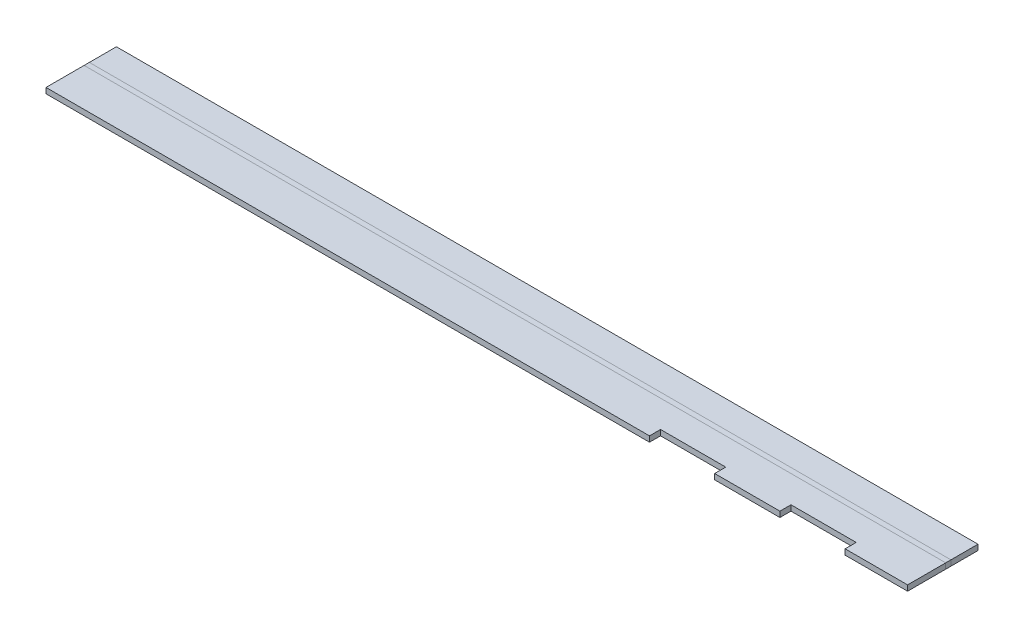
ISO-10303-21;
HEADER;
FILE_DESCRIPTION(('STEP AP214'),'2;1');
FILE_NAME('part.step','',(''),(''),'','','');
FILE_SCHEMA(('AUTOMOTIVE_DESIGN { 1 0 10303 214 1 1 1 1 }'));
ENDSEC;
DATA;
#1=APPLICATION_CONTEXT('core data for automotive mechanical design processes');
#2=APPLICATION_PROTOCOL_DEFINITION('international standard','automotive_design',2000,#1);
#3=PRODUCT_CONTEXT('',#1,'mechanical');
#4=PRODUCT('Part','Part','',(#3));
#5=PRODUCT_RELATED_PRODUCT_CATEGORY('part','',(#4));
#6=PRODUCT_DEFINITION_FORMATION('','',#4);
#7=PRODUCT_DEFINITION_CONTEXT('part definition',#1,'design');
#8=PRODUCT_DEFINITION('design','',#6,#7);
#9=PRODUCT_DEFINITION_SHAPE('','',#8);
#10=(LENGTH_UNIT() NAMED_UNIT(*) SI_UNIT(.MILLI.,.METRE.));
#11=(NAMED_UNIT(*) PLANE_ANGLE_UNIT() SI_UNIT($,.RADIAN.));
#12=(NAMED_UNIT(*) SI_UNIT($,.STERADIAN.) SOLID_ANGLE_UNIT());
#13=UNCERTAINTY_MEASURE_WITH_UNIT(LENGTH_MEASURE(1.E-05),#10,'distance_accuracy_value','');
#14=(GEOMETRIC_REPRESENTATION_CONTEXT(3) GLOBAL_UNCERTAINTY_ASSIGNED_CONTEXT((#13)) GLOBAL_UNIT_ASSIGNED_CONTEXT((#10,
#11,#12)) REPRESENTATION_CONTEXT('',''));
#15=CARTESIAN_POINT('',(0.,0.,0.));
#16=DIRECTION('',(0.,0.,1.));
#17=DIRECTION('',(1.,0.,0.));
#18=AXIS2_PLACEMENT_3D('',#15,#16,#17);
#19=CARTESIAN_POINT('',(19.7993,2.032,1.71258936020354));
#20=DIRECTION('',(0.,0.,-1.));
#21=DIRECTION('',(-1.,0.,0.));
#22=AXIS2_PLACEMENT_3D('',#19,#20,#21);
#23=PLANE('',#22);
#24=DIRECTION('',(1.,0.,0.));
#25=VECTOR('',#24,1.);
#26=CARTESIAN_POINT('',(19.7993,1.778,1.71258936020354));
#27=LINE('',#26,#25);
#28=CARTESIAN_POINT('',(13.9319,1.778,1.71258936020354));
#29=VERTEX_POINT('',#28);
#30=CARTESIAN_POINT('',(10.9347,1.778,1.71258936020354));
#31=VERTEX_POINT('',#30);
#32=EDGE_CURVE('E216',#29,#31,#27,.F.);
#33=ORIENTED_EDGE('',*,*,#32,.F.);
#34=DIRECTION('',(0.,1.,0.));
#35=VECTOR('',#34,1.);
#36=CARTESIAN_POINT('',(13.9319,-1.26194602583664,1.71258936020354));
#37=LINE('',#36,#35);
#38=CARTESIAN_POINT('',(13.9319,2.032,1.71258936020354));
#39=VERTEX_POINT('',#38);
#40=EDGE_CURVE('E261',#29,#39,#37,.T.);
#41=ORIENTED_EDGE('',*,*,#40,.T.);
#42=DIRECTION('',(-1.,0.,0.));
#43=VECTOR('',#42,1.);
#44=CARTESIAN_POINT('',(19.7993,2.032,1.71258936020354));
#45=LINE('',#44,#43);
#46=CARTESIAN_POINT('',(10.9347,2.032,1.71258936020354));
#47=VERTEX_POINT('',#46);
#48=EDGE_CURVE('E222',#39,#47,#45,.T.);
#49=ORIENTED_EDGE('',*,*,#48,.T.);
#50=DIRECTION('',(0.,1.,0.));
#51=VECTOR('',#50,1.);
#52=CARTESIAN_POINT('',(10.9347,-1.26194602583664,1.71258936020354));
#53=LINE('',#52,#51);
#54=EDGE_CURVE('E249',#31,#47,#53,.T.);
#55=ORIENTED_EDGE('',*,*,#54,.F.);
#56=EDGE_LOOP('',(#33,#41,#49,#55));
#57=FACE_BOUND('',#56,.T.);
#58=ADVANCED_FACE('F41',(#57),#23,.F.);
#59=CARTESIAN_POINT('',(7.9375,1.778,1.71258936020354));
#60=VERTEX_POINT('',#59);
#61=CARTESIAN_POINT('',(-19.7993,1.778,1.71258936020354));
#62=VERTEX_POINT('',#61);
#63=EDGE_CURVE('E210',#60,#62,#27,.F.);
#64=ORIENTED_EDGE('',*,*,#63,.F.);
#65=DIRECTION('',(0.,1.,0.));
#66=VECTOR('',#65,1.);
#67=CARTESIAN_POINT('',(7.9375,-1.26194602583664,1.71258936020354));
#68=LINE('',#67,#66);
#69=CARTESIAN_POINT('',(7.9375,2.032,1.71258936020354));
#70=VERTEX_POINT('',#69);
#71=EDGE_CURVE('E246',#60,#70,#68,.T.);
#72=ORIENTED_EDGE('',*,*,#71,.T.);
#73=CARTESIAN_POINT('',(-19.7993,2.032,1.71258936020354));
#74=VERTEX_POINT('',#73);
#75=EDGE_CURVE('E223',#70,#74,#45,.T.);
#76=ORIENTED_EDGE('',*,*,#75,.T.);
#77=DIRECTION('',(0.,1.,0.));
#78=VECTOR('',#77,1.);
#79=CARTESIAN_POINT('',(-19.7993,2.032,1.71258936020354));
#80=LINE('',#79,#78);
#81=EDGE_CURVE('E167',#62,#74,#80,.T.);
#82=ORIENTED_EDGE('',*,*,#81,.F.);
#83=EDGE_LOOP('',(#64,#72,#76,#82));
#84=FACE_BOUND('',#83,.T.);
#85=ADVANCED_FACE('F350',(#84),#23,.F.);
#86=CARTESIAN_POINT('',(19.7993,2.032,1.71258936020354));
#87=DIRECTION('',(0.,1.,0.));
#88=DIRECTION('',(1.,0.,0.));
#89=AXIS2_PLACEMENT_3D('',#86,#87,#88);
#90=PLANE('',#89);
#91=ORIENTED_EDGE('',*,*,#48,.F.);
#92=DIRECTION('',(0.,0.,-1.));
#93=VECTOR('',#92,1.);
#94=CARTESIAN_POINT('',(13.9319,2.032,1.71258936020354));
#95=LINE('',#94,#93);
#96=CARTESIAN_POINT('',(13.9319,2.032,1.20458936020354));
#97=VERTEX_POINT('',#96);
#98=EDGE_CURVE('E257',#39,#97,#95,.T.);
#99=ORIENTED_EDGE('',*,*,#98,.T.);
#100=DIRECTION('',(1.,0.,0.));
#101=VECTOR('',#100,1.);
#102=CARTESIAN_POINT('',(0.,2.032,1.20458936020354));
#103=LINE('',#102,#101);
#104=CARTESIAN_POINT('',(16.9291,2.032,1.20458936020354));
#105=VERTEX_POINT('',#104);
#106=EDGE_CURVE('E267',#97,#105,#103,.T.);
#107=ORIENTED_EDGE('',*,*,#106,.T.);
#108=DIRECTION('',(0.,0.,-1.));
#109=VECTOR('',#108,1.);
#110=CARTESIAN_POINT('',(16.9291,2.032,1.71258936020354));
#111=LINE('',#110,#109);
#112=CARTESIAN_POINT('',(16.9291,2.032,1.71258936020354));
#113=VERTEX_POINT('',#112);
#114=EDGE_CURVE('E240',#113,#105,#111,.T.);
#115=ORIENTED_EDGE('',*,*,#114,.F.);
#116=CARTESIAN_POINT('',(19.7993,2.032,1.71258936020354));
#117=VERTEX_POINT('',#116);
#118=EDGE_CURVE('E186',#117,#113,#45,.T.);
#119=ORIENTED_EDGE('',*,*,#118,.F.);
#120=DIRECTION('',(0.,0.,-1.));
#121=VECTOR('',#120,1.);
#122=CARTESIAN_POINT('',(19.7993,2.032,1.71258936020354));
#123=LINE('',#122,#121);
#124=CARTESIAN_POINT('',(19.7993,2.032,-0.0400106397964578));
#125=VERTEX_POINT('',#124);
#126=EDGE_CURVE('E181',#117,#125,#123,.T.);
#127=ORIENTED_EDGE('',*,*,#126,.T.);
#128=DIRECTION('',(-1.,0.,0.));
#129=VECTOR('',#128,1.);
#130=CARTESIAN_POINT('',(19.7993,2.032,-0.0400106397964578));
#131=LINE('',#130,#129);
#132=CARTESIAN_POINT('',(-19.7993,2.032,-0.0400106397964578));
#133=VERTEX_POINT('',#132);
#134=EDGE_CURVE('E155',#125,#133,#131,.T.);
#135=ORIENTED_EDGE('',*,*,#134,.T.);
#136=DIRECTION('',(0.,0.,-1.));
#137=VECTOR('',#136,1.);
#138=CARTESIAN_POINT('',(-19.7993,2.032,1.71258936020354));
#139=LINE('',#138,#137);
#140=EDGE_CURVE('E218',#74,#133,#139,.T.);
#141=ORIENTED_EDGE('',*,*,#140,.F.);
#142=ORIENTED_EDGE('',*,*,#75,.F.);
#143=DIRECTION('',(0.,0.,-1.));
#144=VECTOR('',#143,1.);
#145=CARTESIAN_POINT('',(7.9375,2.032,1.71258936020354));
#146=LINE('',#145,#144);
#147=CARTESIAN_POINT('',(7.9375,2.032,1.20458936020354));
#148=VERTEX_POINT('',#147);
#149=EDGE_CURVE('E237',#70,#148,#146,.T.);
#150=ORIENTED_EDGE('',*,*,#149,.T.);
#151=DIRECTION('',(1.,0.,0.));
#152=VECTOR('',#151,1.);
#153=CARTESIAN_POINT('',(7.9375,2.032,1.20458936020354));
#154=LINE('',#153,#152);
#155=CARTESIAN_POINT('',(10.9347,2.032,1.20458936020354));
#156=VERTEX_POINT('',#155);
#157=EDGE_CURVE('E241',#148,#156,#154,.T.);
#158=ORIENTED_EDGE('',*,*,#157,.T.);
#159=DIRECTION('',(0.,0.,-1.));
#160=VECTOR('',#159,1.);
#161=CARTESIAN_POINT('',(10.9347,2.032,1.71258936020354));
#162=LINE('',#161,#160);
#163=EDGE_CURVE('E244',#47,#156,#162,.T.);
#164=ORIENTED_EDGE('',*,*,#163,.F.);
#165=EDGE_LOOP('',(#91,#99,#107,#115,#119,#127,#135,#141,#142,#150,#158,#164));
#166=FACE_BOUND('',#165,.T.);
#167=ADVANCED_FACE('F183',(#166),#90,.T.);
#168=CARTESIAN_POINT('',(19.7993,1.778,1.71258936020354));
#169=DIRECTION('',(0.,1.,0.));
#170=DIRECTION('',(1.,0.,0.));
#171=AXIS2_PLACEMENT_3D('',#168,#169,#170);
#172=PLANE('',#171);
#173=DIRECTION('',(0.,0.,1.));
#174=VECTOR('',#173,1.);
#175=CARTESIAN_POINT('',(13.9319,1.778,1.71258936020354));
#176=LINE('',#175,#174);
#177=CARTESIAN_POINT('',(13.9319,1.778,1.20458936020354));
#178=VERTEX_POINT('',#177);
#179=EDGE_CURVE('E254',#178,#29,#176,.T.);
#180=ORIENTED_EDGE('',*,*,#179,.T.);
#181=ORIENTED_EDGE('',*,*,#32,.T.);
#182=DIRECTION('',(0.,0.,1.));
#183=VECTOR('',#182,1.);
#184=CARTESIAN_POINT('',(10.9347,1.778,1.71258936020354));
#185=LINE('',#184,#183);
#186=CARTESIAN_POINT('',(10.9347,1.778,1.20458936020354));
#187=VERTEX_POINT('',#186);
#188=EDGE_CURVE('E227',#187,#31,#185,.T.);
#189=ORIENTED_EDGE('',*,*,#188,.F.);
#190=DIRECTION('',(-1.,0.,0.));
#191=VECTOR('',#190,1.);
#192=CARTESIAN_POINT('',(7.9375,1.778,1.20458936020354));
#193=LINE('',#192,#191);
#194=CARTESIAN_POINT('',(7.9375,1.778,1.20458936020354));
#195=VERTEX_POINT('',#194);
#196=EDGE_CURVE('E230',#187,#195,#193,.T.);
#197=ORIENTED_EDGE('',*,*,#196,.T.);
#198=DIRECTION('',(0.,0.,1.));
#199=VECTOR('',#198,1.);
#200=CARTESIAN_POINT('',(7.9375,1.778,1.71258936020354));
#201=LINE('',#200,#199);
#202=EDGE_CURVE('E233',#195,#60,#201,.T.);
#203=ORIENTED_EDGE('',*,*,#202,.T.);
#204=ORIENTED_EDGE('',*,*,#63,.T.);
#205=DIRECTION('',(0.,0.,-1.));
#206=VECTOR('',#205,1.);
#207=CARTESIAN_POINT('',(-19.7993,1.778,1.71258936020354));
#208=LINE('',#207,#206);
#209=CARTESIAN_POINT('',(-19.7993,1.778,-0.0400106397964578));
#210=VERTEX_POINT('',#209);
#211=EDGE_CURVE('E206',#62,#210,#208,.T.);
#212=ORIENTED_EDGE('',*,*,#211,.T.);
#213=DIRECTION('',(-1.,0.,0.));
#214=VECTOR('',#213,1.);
#215=CARTESIAN_POINT('',(19.7993,1.778,-0.0400106397964578));
#216=LINE('',#215,#214);
#217=CARTESIAN_POINT('',(19.7993,1.778,-0.0400106397964578));
#218=VERTEX_POINT('',#217);
#219=EDGE_CURVE('E50',#218,#210,#216,.T.);
#220=ORIENTED_EDGE('',*,*,#219,.F.);
#221=DIRECTION('',(0.,0.,-1.));
#222=VECTOR('',#221,1.);
#223=CARTESIAN_POINT('',(19.7993,1.778,1.71258936020354));
#224=LINE('',#223,#222);
#225=CARTESIAN_POINT('',(19.7993,1.778,1.71258936020354));
#226=VERTEX_POINT('',#225);
#227=EDGE_CURVE('E194',#226,#218,#224,.T.);
#228=ORIENTED_EDGE('',*,*,#227,.F.);
#229=CARTESIAN_POINT('',(16.9291,1.778,1.71258936020354));
#230=VERTEX_POINT('',#229);
#231=EDGE_CURVE('E212',#226,#230,#27,.F.);
#232=ORIENTED_EDGE('',*,*,#231,.T.);
#233=DIRECTION('',(0.,0.,1.));
#234=VECTOR('',#233,1.);
#235=CARTESIAN_POINT('',(16.9291,1.778,1.71258936020354));
#236=LINE('',#235,#234);
#237=CARTESIAN_POINT('',(16.9291,1.778,1.20458936020354));
#238=VERTEX_POINT('',#237);
#239=EDGE_CURVE('E211',#238,#230,#236,.T.);
#240=ORIENTED_EDGE('',*,*,#239,.F.);
#241=DIRECTION('',(-1.,0.,0.));
#242=VECTOR('',#241,1.);
#243=CARTESIAN_POINT('',(0.,1.778,1.20458936020354));
#244=LINE('',#243,#242);
#245=EDGE_CURVE('E264',#238,#178,#244,.T.);
#246=ORIENTED_EDGE('',*,*,#245,.T.);
#247=EDGE_LOOP('',(#180,#181,#189,#197,#203,#204,#212,#220,#228,#232,#240,#246));
#248=FACE_BOUND('',#247,.T.);
#249=ADVANCED_FACE('F360',(#248),#172,.F.);
#250=DIRECTION('',(0.,1.,0.));
#251=VECTOR('',#250,1.);
#252=CARTESIAN_POINT('',(16.9291,-1.26194602583664,1.71258936020354));
#253=LINE('',#252,#251);
#254=EDGE_CURVE('E255',#230,#113,#253,.T.);
#255=ORIENTED_EDGE('',*,*,#254,.F.);
#256=ORIENTED_EDGE('',*,*,#231,.F.);
#257=DIRECTION('',(0.,1.,0.));
#258=VECTOR('',#257,1.);
#259=CARTESIAN_POINT('',(19.7993,2.032,1.71258936020354));
#260=LINE('',#259,#258);
#261=EDGE_CURVE('E189',#226,#117,#260,.T.);
#262=ORIENTED_EDGE('',*,*,#261,.T.);
#263=ORIENTED_EDGE('',*,*,#118,.T.);
#264=EDGE_LOOP('',(#255,#256,#262,#263));
#265=FACE_BOUND('',#264,.T.);
#266=ADVANCED_FACE('F352',(#265),#23,.F.);
#267=CARTESIAN_POINT('',(19.7993,2.032,1.71258936020354));
#268=DIRECTION('',(1.,0.,0.));
#269=DIRECTION('',(0.,0.,-1.));
#270=AXIS2_PLACEMENT_3D('',#267,#268,#269);
#271=PLANE('',#270);
#272=ORIENTED_EDGE('',*,*,#261,.F.);
#273=ORIENTED_EDGE('',*,*,#227,.T.);
#274=DIRECTION('',(0.,1.,0.));
#275=VECTOR('',#274,1.);
#276=CARTESIAN_POINT('',(19.7993,2.032,-0.0400106397964578));
#277=LINE('',#276,#275);
#278=EDGE_CURVE('E166',#218,#125,#277,.T.);
#279=ORIENTED_EDGE('',*,*,#278,.T.);
#280=ORIENTED_EDGE('',*,*,#126,.F.);
#281=EDGE_LOOP('',(#272,#273,#279,#280));
#282=FACE_BOUND('',#281,.T.);
#283=ADVANCED_FACE('F192',(#282),#271,.T.);
#284=CARTESIAN_POINT('',(-19.7993,2.032,1.71258936020354));
#285=DIRECTION('',(1.,0.,0.));
#286=DIRECTION('',(0.,0.,-1.));
#287=AXIS2_PLACEMENT_3D('',#284,#285,#286);
#288=PLANE('',#287);
#289=ORIENTED_EDGE('',*,*,#211,.F.);
#290=ORIENTED_EDGE('',*,*,#81,.T.);
#291=ORIENTED_EDGE('',*,*,#140,.T.);
#292=DIRECTION('',(0.,1.,0.));
#293=VECTOR('',#292,1.);
#294=CARTESIAN_POINT('',(-19.7993,2.032,-0.0400106397964578));
#295=LINE('',#294,#293);
#296=EDGE_CURVE('E11',#210,#133,#295,.T.);
#297=ORIENTED_EDGE('',*,*,#296,.F.);
#298=EDGE_LOOP('',(#289,#290,#291,#297));
#299=FACE_BOUND('',#298,.T.);
#300=ADVANCED_FACE('F43',(#299),#288,.F.);
#301=CARTESIAN_POINT('',(7.9375,-1.26194602583664,1.71258936020354));
#302=DIRECTION('',(1.,0.,0.));
#303=DIRECTION('',(0.,-1.,0.));
#304=AXIS2_PLACEMENT_3D('',#301,#302,#303);
#305=PLANE('',#304);
#306=DIRECTION('',(0.,1.,0.));
#307=VECTOR('',#306,1.);
#308=CARTESIAN_POINT('',(7.9375,-1.26194602583664,1.20458936020354));
#309=LINE('',#308,#307);
#310=EDGE_CURVE('E229',#195,#148,#309,.T.);
#311=ORIENTED_EDGE('',*,*,#310,.T.);
#312=ORIENTED_EDGE('',*,*,#149,.F.);
#313=ORIENTED_EDGE('',*,*,#71,.F.);
#314=ORIENTED_EDGE('',*,*,#202,.F.);
#315=EDGE_LOOP('',(#311,#312,#313,#314));
#316=FACE_BOUND('',#315,.T.);
#317=ADVANCED_FACE('F417',(#316),#305,.T.);
#318=CARTESIAN_POINT('',(7.9375,-1.26194602583664,1.20458936020354));
#319=DIRECTION('',(0.,0.,1.));
#320=DIRECTION('',(0.,-1.,0.));
#321=AXIS2_PLACEMENT_3D('',#318,#319,#320);
#322=PLANE('',#321);
#323=DIRECTION('',(0.,1.,0.));
#324=VECTOR('',#323,1.);
#325=CARTESIAN_POINT('',(10.9347,-1.26194602583664,1.20458936020354));
#326=LINE('',#325,#324);
#327=EDGE_CURVE('E65',#187,#156,#326,.T.);
#328=ORIENTED_EDGE('',*,*,#327,.T.);
#329=ORIENTED_EDGE('',*,*,#157,.F.);
#330=ORIENTED_EDGE('',*,*,#310,.F.);
#331=ORIENTED_EDGE('',*,*,#196,.F.);
#332=EDGE_LOOP('',(#328,#329,#330,#331));
#333=FACE_BOUND('',#332,.T.);
#334=ADVANCED_FACE('F420',(#333),#322,.T.);
#335=CARTESIAN_POINT('',(10.9347,-1.26194602583664,1.71258936020354));
#336=DIRECTION('',(1.,0.,0.));
#337=DIRECTION('',(0.,-1.,0.));
#338=AXIS2_PLACEMENT_3D('',#335,#336,#337);
#339=PLANE('',#338);
#340=ORIENTED_EDGE('',*,*,#188,.T.);
#341=ORIENTED_EDGE('',*,*,#54,.T.);
#342=ORIENTED_EDGE('',*,*,#163,.T.);
#343=ORIENTED_EDGE('',*,*,#327,.F.);
#344=EDGE_LOOP('',(#340,#341,#342,#343));
#345=FACE_BOUND('',#344,.T.);
#346=ADVANCED_FACE('F387',(#345),#339,.F.);
#347=CARTESIAN_POINT('',(13.9319,-1.26194602583664,1.71258936020354));
#348=DIRECTION('',(1.,0.,0.));
#349=DIRECTION('',(0.,-1.,0.));
#350=AXIS2_PLACEMENT_3D('',#347,#348,#349);
#351=PLANE('',#350);
#352=DIRECTION('',(0.,1.,0.));
#353=VECTOR('',#352,1.);
#354=CARTESIAN_POINT('',(13.9319,-1.26194602583664,1.20458936020354));
#355=LINE('',#354,#353);
#356=EDGE_CURVE('E259',#178,#97,#355,.T.);
#357=ORIENTED_EDGE('',*,*,#356,.T.);
#358=ORIENTED_EDGE('',*,*,#98,.F.);
#359=ORIENTED_EDGE('',*,*,#40,.F.);
#360=ORIENTED_EDGE('',*,*,#179,.F.);
#361=EDGE_LOOP('',(#357,#358,#359,#360));
#362=FACE_BOUND('',#361,.T.);
#363=ADVANCED_FACE('F402',(#362),#351,.T.);
#364=CARTESIAN_POINT('',(0.,-1.26194602583664,1.20458936020354));
#365=DIRECTION('',(0.,0.,1.));
#366=DIRECTION('',(0.,-1.,0.));
#367=AXIS2_PLACEMENT_3D('',#364,#365,#366);
#368=PLANE('',#367);
#369=DIRECTION('',(0.,1.,0.));
#370=VECTOR('',#369,1.);
#371=CARTESIAN_POINT('',(16.9291,-1.26194602583664,1.20458936020354));
#372=LINE('',#371,#370);
#373=EDGE_CURVE('E57',#238,#105,#372,.T.);
#374=ORIENTED_EDGE('',*,*,#373,.T.);
#375=ORIENTED_EDGE('',*,*,#106,.F.);
#376=ORIENTED_EDGE('',*,*,#356,.F.);
#377=ORIENTED_EDGE('',*,*,#245,.F.);
#378=EDGE_LOOP('',(#374,#375,#376,#377));
#379=FACE_BOUND('',#378,.T.);
#380=ADVANCED_FACE('F405',(#379),#368,.T.);
#381=CARTESIAN_POINT('',(16.9291,-1.26194602583664,1.71258936020354));
#382=DIRECTION('',(1.,0.,0.));
#383=DIRECTION('',(0.,-1.,0.));
#384=AXIS2_PLACEMENT_3D('',#381,#382,#383);
#385=PLANE('',#384);
#386=ORIENTED_EDGE('',*,*,#239,.T.);
#387=ORIENTED_EDGE('',*,*,#254,.T.);
#388=ORIENTED_EDGE('',*,*,#114,.T.);
#389=ORIENTED_EDGE('',*,*,#373,.F.);
#390=EDGE_LOOP('',(#386,#387,#388,#389));
#391=FACE_BOUND('',#390,.T.);
#392=ADVANCED_FACE('F406',(#391),#385,.F.);
#393=CARTESIAN_POINT('',(19.7993,2.032,-1.524));
#394=DIRECTION('',(0.,0.,-1.));
#395=DIRECTION('',(-1.,0.,0.));
#396=AXIS2_PLACEMENT_3D('',#393,#394,#395);
#397=PLANE('',#396);
#398=DIRECTION('',(0.,1.,0.));
#399=VECTOR('',#398,1.);
#400=CARTESIAN_POINT('',(19.7993,2.032,-1.524));
#401=LINE('',#400,#399);
#402=CARTESIAN_POINT('',(19.7993,1.778,-1.524));
#403=VERTEX_POINT('',#402);
#404=CARTESIAN_POINT('',(19.7993,2.032,-1.524));
#405=VERTEX_POINT('',#404);
#406=EDGE_CURVE('E298',#403,#405,#401,.T.);
#407=ORIENTED_EDGE('',*,*,#406,.F.);
#408=DIRECTION('',(1.,0.,0.));
#409=VECTOR('',#408,1.);
#410=CARTESIAN_POINT('',(19.7993,1.778,-1.524));
#411=LINE('',#410,#409);
#412=CARTESIAN_POINT('',(-19.7993,1.778,-1.524));
#413=VERTEX_POINT('',#412);
#414=EDGE_CURVE('E279',#403,#413,#411,.F.);
#415=ORIENTED_EDGE('',*,*,#414,.T.);
#416=DIRECTION('',(0.,1.,0.));
#417=VECTOR('',#416,1.);
#418=CARTESIAN_POINT('',(-19.7993,2.032,-1.524));
#419=LINE('',#418,#417);
#420=CARTESIAN_POINT('',(-19.7993,2.032,-1.524));
#421=VERTEX_POINT('',#420);
#422=EDGE_CURVE('E283',#413,#421,#419,.T.);
#423=ORIENTED_EDGE('',*,*,#422,.T.);
#424=DIRECTION('',(-1.,0.,0.));
#425=VECTOR('',#424,1.);
#426=CARTESIAN_POINT('',(19.7993,2.032,-1.524));
#427=LINE('',#426,#425);
#428=EDGE_CURVE('E290',#405,#421,#427,.T.);
#429=ORIENTED_EDGE('',*,*,#428,.F.);
#430=EDGE_LOOP('',(#407,#415,#423,#429));
#431=FACE_BOUND('',#430,.T.);
#432=ADVANCED_FACE('F335',(#431),#397,.T.);
#433=CARTESIAN_POINT('',(19.7993,2.032,-0.2794));
#434=DIRECTION('',(0.,1.,0.));
#435=DIRECTION('',(0.,0.,1.));
#436=AXIS2_PLACEMENT_3D('',#433,#434,#435);
#437=PLANE('',#436);
#438=DIRECTION('',(0.,0.,-1.));
#439=VECTOR('',#438,1.);
#440=CARTESIAN_POINT('',(-19.7993,2.032,-0.2794));
#441=LINE('',#440,#439);
#442=CARTESIAN_POINT('',(-19.7993,2.032,-0.2794));
#443=VERTEX_POINT('',#442);
#444=EDGE_CURVE('E236',#443,#421,#441,.T.);
#445=ORIENTED_EDGE('',*,*,#444,.F.);
#446=DIRECTION('',(-1.,0.,0.));
#447=VECTOR('',#446,1.);
#448=CARTESIAN_POINT('',(19.7993,2.032,-0.2794));
#449=LINE('',#448,#447);
#450=CARTESIAN_POINT('',(19.7993,2.032,-0.2794));
#451=VERTEX_POINT('',#450);
#452=EDGE_CURVE('E177',#451,#443,#449,.T.);
#453=ORIENTED_EDGE('',*,*,#452,.F.);
#454=DIRECTION('',(0.,0.,-1.));
#455=VECTOR('',#454,1.);
#456=CARTESIAN_POINT('',(19.7993,2.032,-0.2794));
#457=LINE('',#456,#455);
#458=EDGE_CURVE('E286',#451,#405,#457,.T.);
#459=ORIENTED_EDGE('',*,*,#458,.T.);
#460=ORIENTED_EDGE('',*,*,#428,.T.);
#461=EDGE_LOOP('',(#445,#453,#459,#460));
#462=FACE_BOUND('',#461,.T.);
#463=ADVANCED_FACE('F337',(#462),#437,.T.);
#464=CARTESIAN_POINT('',(19.7993,2.032,-0.2794));
#465=DIRECTION('',(1.,0.,0.));
#466=DIRECTION('',(0.,0.,-1.));
#467=AXIS2_PLACEMENT_3D('',#464,#465,#466);
#468=PLANE('',#467);
#469=DIRECTION('',(0.,1.,0.));
#470=VECTOR('',#469,1.);
#471=CARTESIAN_POINT('',(19.7993,2.032,-0.2794));
#472=LINE('',#471,#470);
#473=CARTESIAN_POINT('',(19.7993,1.778,-0.2794));
#474=VERTEX_POINT('',#473);
#475=EDGE_CURVE('E176',#474,#451,#472,.T.);
#476=ORIENTED_EDGE('',*,*,#475,.F.);
#477=DIRECTION('',(0.,0.,1.));
#478=VECTOR('',#477,1.);
#479=CARTESIAN_POINT('',(19.7993,1.778,-0.2794));
#480=LINE('',#479,#478);
#481=EDGE_CURVE('E294',#474,#403,#480,.F.);
#482=ORIENTED_EDGE('',*,*,#481,.T.);
#483=ORIENTED_EDGE('',*,*,#406,.T.);
#484=ORIENTED_EDGE('',*,*,#458,.F.);
#485=EDGE_LOOP('',(#476,#482,#483,#484));
#486=FACE_BOUND('',#485,.T.);
#487=ADVANCED_FACE('F340',(#486),#468,.T.);
#488=CARTESIAN_POINT('',(19.7993,1.778,-0.2794));
#489=DIRECTION('',(0.,1.,0.));
#490=DIRECTION('',(0.,0.,1.));
#491=AXIS2_PLACEMENT_3D('',#488,#489,#490);
#492=PLANE('',#491);
#493=DIRECTION('',(0.,0.,1.));
#494=VECTOR('',#493,1.);
#495=CARTESIAN_POINT('',(-19.7993,1.778,-0.2794));
#496=LINE('',#495,#494);
#497=CARTESIAN_POINT('',(-19.7993,1.778,-0.2794));
#498=VERTEX_POINT('',#497);
#499=EDGE_CURVE('E301',#498,#413,#496,.F.);
#500=ORIENTED_EDGE('',*,*,#499,.T.);
#501=ORIENTED_EDGE('',*,*,#414,.F.);
#502=ORIENTED_EDGE('',*,*,#481,.F.);
#503=DIRECTION('',(-1.,0.,0.));
#504=VECTOR('',#503,1.);
#505=CARTESIAN_POINT('',(19.7993,1.778,-0.2794));
#506=LINE('',#505,#504);
#507=EDGE_CURVE('E305',#474,#498,#506,.T.);
#508=ORIENTED_EDGE('',*,*,#507,.T.);
#509=EDGE_LOOP('',(#500,#501,#502,#508));
#510=FACE_BOUND('',#509,.T.);
#511=ADVANCED_FACE('F327',(#510),#492,.F.);
#512=CARTESIAN_POINT('',(-19.7993,2.032,-0.2794));
#513=DIRECTION('',(1.,0.,0.));
#514=DIRECTION('',(0.,0.,-1.));
#515=AXIS2_PLACEMENT_3D('',#512,#513,#514);
#516=PLANE('',#515);
#517=ORIENTED_EDGE('',*,*,#422,.F.);
#518=ORIENTED_EDGE('',*,*,#499,.F.);
#519=DIRECTION('',(0.,1.,0.));
#520=VECTOR('',#519,1.);
#521=CARTESIAN_POINT('',(-19.7993,2.032,-0.2794));
#522=LINE('',#521,#520);
#523=EDGE_CURVE('E309',#498,#443,#522,.T.);
#524=ORIENTED_EDGE('',*,*,#523,.T.);
#525=ORIENTED_EDGE('',*,*,#444,.T.);
#526=EDGE_LOOP('',(#517,#518,#524,#525));
#527=FACE_BOUND('',#526,.T.);
#528=ADVANCED_FACE('F332',(#527),#516,.F.);
#529=CARTESIAN_POINT('',(-19.7993,2.032,-0.0400106397964578));
#530=DIRECTION('',(-1.,0.,0.));
#531=DIRECTION('',(0.,0.,1.));
#532=AXIS2_PLACEMENT_3D('',#529,#530,#531);
#533=PLANE('',#532);
#534=ORIENTED_EDGE('',*,*,#523,.F.);
#535=DIRECTION('',(0.,0.,1.));
#536=VECTOR('',#535,1.);
#537=CARTESIAN_POINT('',(-19.7993,1.778,-0.159705319898229));
#538=LINE('',#537,#536);
#539=EDGE_CURVE('E316',#498,#210,#538,.T.);
#540=ORIENTED_EDGE('',*,*,#539,.T.);
#541=ORIENTED_EDGE('',*,*,#296,.T.);
#542=DIRECTION('',(0.,0.,1.));
#543=VECTOR('',#542,1.);
#544=CARTESIAN_POINT('',(-19.7993,2.032,-0.0400106397964578));
#545=LINE('',#544,#543);
#546=EDGE_CURVE('E161',#443,#133,#545,.T.);
#547=ORIENTED_EDGE('',*,*,#546,.F.);
#548=EDGE_LOOP('',(#534,#540,#541,#547));
#549=FACE_BOUND('',#548,.T.);
#550=ADVANCED_FACE('F330',(#549),#533,.T.);
#551=CARTESIAN_POINT('',(19.7993,2.032,-0.0400106397964578));
#552=DIRECTION('',(1.,0.,0.));
#553=DIRECTION('',(0.,0.,-1.));
#554=AXIS2_PLACEMENT_3D('',#551,#552,#553);
#555=PLANE('',#554);
#556=ORIENTED_EDGE('',*,*,#278,.F.);
#557=DIRECTION('',(0.,0.,1.));
#558=VECTOR('',#557,1.);
#559=CARTESIAN_POINT('',(19.7993,1.778,-0.159705319898229));
#560=LINE('',#559,#558);
#561=EDGE_CURVE('E319',#218,#474,#560,.F.);
#562=ORIENTED_EDGE('',*,*,#561,.T.);
#563=ORIENTED_EDGE('',*,*,#475,.T.);
#564=DIRECTION('',(0.,0.,-1.));
#565=VECTOR('',#564,1.);
#566=CARTESIAN_POINT('',(19.7993,2.032,-0.0400106397964578));
#567=LINE('',#566,#565);
#568=EDGE_CURVE('E159',#125,#451,#567,.T.);
#569=ORIENTED_EDGE('',*,*,#568,.F.);
#570=EDGE_LOOP('',(#556,#562,#563,#569));
#571=FACE_BOUND('',#570,.T.);
#572=ADVANCED_FACE('F171',(#571),#555,.T.);
#573=CARTESIAN_POINT('',(0.,2.032,-0.159705319898229));
#574=DIRECTION('',(0.,1.,0.));
#575=DIRECTION('',(0.,0.,1.));
#576=AXIS2_PLACEMENT_3D('',#573,#574,#575);
#577=PLANE('',#576);
#578=ORIENTED_EDGE('',*,*,#568,.T.);
#579=ORIENTED_EDGE('',*,*,#452,.T.);
#580=ORIENTED_EDGE('',*,*,#546,.T.);
#581=ORIENTED_EDGE('',*,*,#134,.F.);
#582=EDGE_LOOP('',(#578,#579,#580,#581));
#583=FACE_BOUND('',#582,.T.);
#584=ADVANCED_FACE('F157',(#583),#577,.T.);
#585=CARTESIAN_POINT('',(0.,1.778,-0.159705319898229));
#586=DIRECTION('',(0.,1.,0.));
#587=DIRECTION('',(0.,0.,1.));
#588=AXIS2_PLACEMENT_3D('',#585,#586,#587);
#589=PLANE('',#588);
#590=ORIENTED_EDGE('',*,*,#561,.F.);
#591=ORIENTED_EDGE('',*,*,#219,.T.);
#592=ORIENTED_EDGE('',*,*,#539,.F.);
#593=ORIENTED_EDGE('',*,*,#507,.F.);
#594=EDGE_LOOP('',(#590,#591,#592,#593));
#595=FACE_BOUND('',#594,.T.);
#596=ADVANCED_FACE('F324',(#595),#589,.F.);
#597=CLOSED_SHELL('',(#58,#85,#167,#249,#266,#283,#300,#317,#334,#346,#363,#380,#392,#432,#463,
#487,#511,#528,#550,#572,#584,#596));
#598=MANIFOLD_SOLID_BREP('B2',#597);
#599=ADVANCED_BREP_SHAPE_REPRESENTATION('',(#18,#598),#14);
#600=SHAPE_DEFINITION_REPRESENTATION(#9,#599);
ENDSEC;
END-ISO-10303-21;
